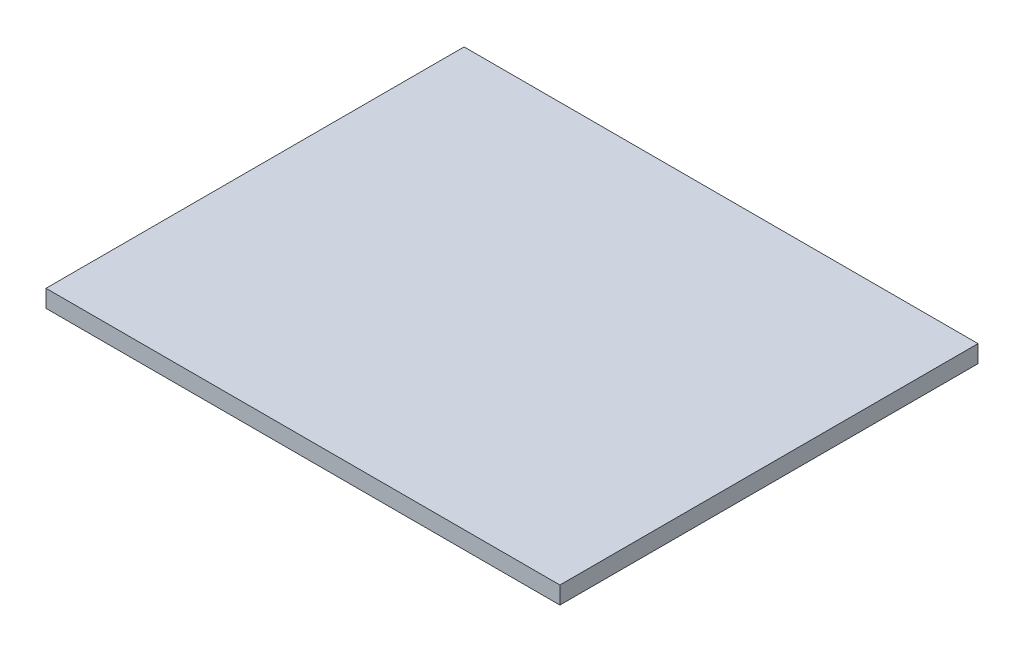
ISO-10303-21;
HEADER;
FILE_DESCRIPTION(('STEP AP214'),'2;1');
FILE_NAME('part.step','',(''),(''),'','','');
FILE_SCHEMA(('AUTOMOTIVE_DESIGN { 1 0 10303 214 1 1 1 1 }'));
ENDSEC;
DATA;
#1=APPLICATION_CONTEXT('core data for automotive mechanical design processes');
#2=APPLICATION_PROTOCOL_DEFINITION('international standard','automotive_design',2000,#1);
#3=PRODUCT_CONTEXT('',#1,'mechanical');
#4=PRODUCT('Part','Part','',(#3));
#5=PRODUCT_RELATED_PRODUCT_CATEGORY('part','',(#4));
#6=PRODUCT_DEFINITION_FORMATION('','',#4);
#7=PRODUCT_DEFINITION_CONTEXT('part definition',#1,'design');
#8=PRODUCT_DEFINITION('design','',#6,#7);
#9=PRODUCT_DEFINITION_SHAPE('','',#8);
#10=(LENGTH_UNIT() NAMED_UNIT(*) SI_UNIT(.MILLI.,.METRE.));
#11=(NAMED_UNIT(*) PLANE_ANGLE_UNIT() SI_UNIT($,.RADIAN.));
#12=(NAMED_UNIT(*) SI_UNIT($,.STERADIAN.) SOLID_ANGLE_UNIT());
#13=UNCERTAINTY_MEASURE_WITH_UNIT(LENGTH_MEASURE(1.E-05),#10,'distance_accuracy_value','');
#14=(GEOMETRIC_REPRESENTATION_CONTEXT(3) GLOBAL_UNCERTAINTY_ASSIGNED_CONTEXT((#13)) GLOBAL_UNIT_ASSIGNED_CONTEXT((#10,
#11,#12)) REPRESENTATION_CONTEXT('',''));
#15=CARTESIAN_POINT('',(0.,0.,0.));
#16=DIRECTION('',(0.,0.,1.));
#17=DIRECTION('',(1.,0.,0.));
#18=AXIS2_PLACEMENT_3D('',#15,#16,#17);
#19=CARTESIAN_POINT('',(59.,4.,48.));
#20=DIRECTION('',(-1.,0.,0.));
#21=DIRECTION('',(0.,0.,1.));
#22=AXIS2_PLACEMENT_3D('',#19,#20,#21);
#23=PLANE('',#22);
#24=DIRECTION('',(0.,0.,-1.));
#25=VECTOR('',#24,1.);
#26=CARTESIAN_POINT('',(59.,0.,48.));
#27=LINE('',#26,#25);
#28=CARTESIAN_POINT('',(59.,0.,48.));
#29=VERTEX_POINT('',#28);
#30=CARTESIAN_POINT('',(59.,0.,-48.));
#31=VERTEX_POINT('',#30);
#32=EDGE_CURVE('E96',#29,#31,#27,.T.);
#33=ORIENTED_EDGE('',*,*,#32,.T.);
#34=DIRECTION('',(0.,-1.,0.));
#35=VECTOR('',#34,1.);
#36=CARTESIAN_POINT('',(59.,4.,-48.));
#37=LINE('',#36,#35);
#38=CARTESIAN_POINT('',(59.,4.,-48.));
#39=VERTEX_POINT('',#38);
#40=EDGE_CURVE('E11',#39,#31,#37,.T.);
#41=ORIENTED_EDGE('',*,*,#40,.F.);
#42=DIRECTION('',(0.,0.,-1.));
#43=VECTOR('',#42,1.);
#44=CARTESIAN_POINT('',(59.,4.,48.));
#45=LINE('',#44,#43);
#46=CARTESIAN_POINT('',(59.,4.,48.));
#47=VERTEX_POINT('',#46);
#48=EDGE_CURVE('E84',#47,#39,#45,.T.);
#49=ORIENTED_EDGE('',*,*,#48,.F.);
#50=DIRECTION('',(0.,-1.,0.));
#51=VECTOR('',#50,1.);
#52=CARTESIAN_POINT('',(59.,4.,48.));
#53=LINE('',#52,#51);
#54=EDGE_CURVE('E92',#47,#29,#53,.T.);
#55=ORIENTED_EDGE('',*,*,#54,.T.);
#56=EDGE_LOOP('',(#33,#41,#49,#55));
#57=FACE_BOUND('',#56,.T.);
#58=ADVANCED_FACE('F33',(#57),#23,.F.);
#59=CARTESIAN_POINT('',(-59.,4.,-48.));
#60=DIRECTION('',(0.,0.,1.));
#61=DIRECTION('',(1.,0.,0.));
#62=AXIS2_PLACEMENT_3D('',#59,#60,#61);
#63=PLANE('',#62);
#64=DIRECTION('',(-1.,0.,0.));
#65=VECTOR('',#64,1.);
#66=CARTESIAN_POINT('',(-59.,0.,-48.));
#67=LINE('',#66,#65);
#68=CARTESIAN_POINT('',(-59.,0.,-48.));
#69=VERTEX_POINT('',#68);
#70=EDGE_CURVE('E88',#31,#69,#67,.T.);
#71=ORIENTED_EDGE('',*,*,#70,.T.);
#72=DIRECTION('',(0.,-1.,0.));
#73=VECTOR('',#72,1.);
#74=CARTESIAN_POINT('',(-59.,4.,-48.));
#75=LINE('',#74,#73);
#76=CARTESIAN_POINT('',(-59.,4.,-48.));
#77=VERTEX_POINT('',#76);
#78=EDGE_CURVE('E41',#77,#69,#75,.T.);
#79=ORIENTED_EDGE('',*,*,#78,.F.);
#80=DIRECTION('',(-1.,0.,0.));
#81=VECTOR('',#80,1.);
#82=CARTESIAN_POINT('',(-59.,4.,-48.));
#83=LINE('',#82,#81);
#84=EDGE_CURVE('E79',#39,#77,#83,.T.);
#85=ORIENTED_EDGE('',*,*,#84,.F.);
#86=ORIENTED_EDGE('',*,*,#40,.T.);
#87=EDGE_LOOP('',(#71,#79,#85,#86));
#88=FACE_BOUND('',#87,.T.);
#89=ADVANCED_FACE('F87',(#88),#63,.F.);
#90=CARTESIAN_POINT('',(-59.,4.,48.));
#91=DIRECTION('',(1.,0.,0.));
#92=DIRECTION('',(0.,0.,-1.));
#93=AXIS2_PLACEMENT_3D('',#90,#91,#92);
#94=PLANE('',#93);
#95=DIRECTION('',(0.,0.,1.));
#96=VECTOR('',#95,1.);
#97=CARTESIAN_POINT('',(-59.,0.,48.));
#98=LINE('',#97,#96);
#99=CARTESIAN_POINT('',(-59.,0.,48.));
#100=VERTEX_POINT('',#99);
#101=EDGE_CURVE('E66',#69,#100,#98,.T.);
#102=ORIENTED_EDGE('',*,*,#101,.T.);
#103=DIRECTION('',(0.,-1.,0.));
#104=VECTOR('',#103,1.);
#105=CARTESIAN_POINT('',(-59.,4.,48.));
#106=LINE('',#105,#104);
#107=CARTESIAN_POINT('',(-59.,4.,48.));
#108=VERTEX_POINT('',#107);
#109=EDGE_CURVE('E89',#108,#100,#106,.T.);
#110=ORIENTED_EDGE('',*,*,#109,.F.);
#111=DIRECTION('',(0.,0.,1.));
#112=VECTOR('',#111,1.);
#113=CARTESIAN_POINT('',(-59.,4.,48.));
#114=LINE('',#113,#112);
#115=EDGE_CURVE('E82',#77,#108,#114,.T.);
#116=ORIENTED_EDGE('',*,*,#115,.F.);
#117=ORIENTED_EDGE('',*,*,#78,.T.);
#118=EDGE_LOOP('',(#102,#110,#116,#117));
#119=FACE_BOUND('',#118,.T.);
#120=ADVANCED_FACE('F90',(#119),#94,.F.);
#121=CARTESIAN_POINT('',(-59.,4.,48.));
#122=DIRECTION('',(0.,0.,-1.));
#123=DIRECTION('',(-1.,0.,0.));
#124=AXIS2_PLACEMENT_3D('',#121,#122,#123);
#125=PLANE('',#124);
#126=DIRECTION('',(1.,0.,0.));
#127=VECTOR('',#126,1.);
#128=CARTESIAN_POINT('',(-59.,0.,48.));
#129=LINE('',#128,#127);
#130=EDGE_CURVE('E72',#100,#29,#129,.T.);
#131=ORIENTED_EDGE('',*,*,#130,.T.);
#132=ORIENTED_EDGE('',*,*,#54,.F.);
#133=DIRECTION('',(1.,0.,0.));
#134=VECTOR('',#133,1.);
#135=CARTESIAN_POINT('',(-59.,4.,48.));
#136=LINE('',#135,#134);
#137=EDGE_CURVE('E49',#108,#47,#136,.T.);
#138=ORIENTED_EDGE('',*,*,#137,.F.);
#139=ORIENTED_EDGE('',*,*,#109,.T.);
#140=EDGE_LOOP('',(#131,#132,#138,#139));
#141=FACE_BOUND('',#140,.T.);
#142=ADVANCED_FACE('F103',(#141),#125,.F.);
#143=CARTESIAN_POINT('',(0.,4.,0.));
#144=DIRECTION('',(0.,-1.,0.));
#145=DIRECTION('',(0.,0.,-1.));
#146=AXIS2_PLACEMENT_3D('',#143,#144,#145);
#147=PLANE('',#146);
#148=ORIENTED_EDGE('',*,*,#48,.T.);
#149=ORIENTED_EDGE('',*,*,#84,.T.);
#150=ORIENTED_EDGE('',*,*,#115,.T.);
#151=ORIENTED_EDGE('',*,*,#137,.T.);
#152=EDGE_LOOP('',(#148,#149,#150,#151));
#153=FACE_BOUND('',#152,.T.);
#154=ADVANCED_FACE('F80',(#153),#147,.F.);
#155=CARTESIAN_POINT('',(0.,0.,0.));
#156=DIRECTION('',(0.,-1.,0.));
#157=DIRECTION('',(0.,0.,-1.));
#158=AXIS2_PLACEMENT_3D('',#155,#156,#157);
#159=PLANE('',#158);
#160=ORIENTED_EDGE('',*,*,#32,.F.);
#161=ORIENTED_EDGE('',*,*,#130,.F.);
#162=ORIENTED_EDGE('',*,*,#101,.F.);
#163=ORIENTED_EDGE('',*,*,#70,.F.);
#164=EDGE_LOOP('',(#160,#161,#162,#163));
#165=FACE_BOUND('',#164,.T.);
#166=ADVANCED_FACE('F106',(#165),#159,.T.);
#167=CLOSED_SHELL('',(#58,#89,#120,#142,#154,#166));
#168=MANIFOLD_SOLID_BREP('B2',#167);
#169=ADVANCED_BREP_SHAPE_REPRESENTATION('',(#18,#168),#14);
#170=SHAPE_DEFINITION_REPRESENTATION(#9,#169);
ENDSEC;
END-ISO-10303-21;
